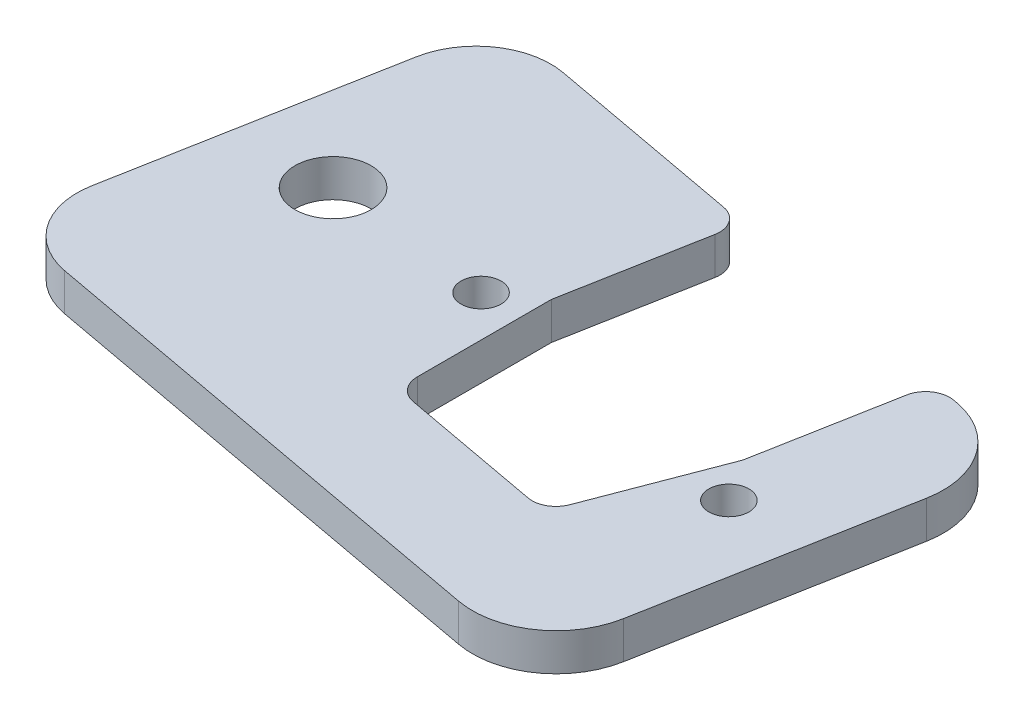
ISO-10303-21;
HEADER;
FILE_DESCRIPTION(('STEP AP214'),'2;1');
FILE_NAME('part.step','',(''),(''),'','','');
FILE_SCHEMA(('AUTOMOTIVE_DESIGN { 1 0 10303 214 1 1 1 1 }'));
ENDSEC;
DATA;
#1=APPLICATION_CONTEXT('core data for automotive mechanical design processes');
#2=APPLICATION_PROTOCOL_DEFINITION('international standard','automotive_design',2000,#1);
#3=PRODUCT_CONTEXT('',#1,'mechanical');
#4=PRODUCT('Part','Part','',(#3));
#5=PRODUCT_RELATED_PRODUCT_CATEGORY('part','',(#4));
#6=PRODUCT_DEFINITION_FORMATION('','',#4);
#7=PRODUCT_DEFINITION_CONTEXT('part definition',#1,'design');
#8=PRODUCT_DEFINITION('design','',#6,#7);
#9=PRODUCT_DEFINITION_SHAPE('','',#8);
#10=(LENGTH_UNIT() NAMED_UNIT(*) SI_UNIT(.MILLI.,.METRE.));
#11=(NAMED_UNIT(*) PLANE_ANGLE_UNIT() SI_UNIT($,.RADIAN.));
#12=(NAMED_UNIT(*) SI_UNIT($,.STERADIAN.) SOLID_ANGLE_UNIT());
#13=UNCERTAINTY_MEASURE_WITH_UNIT(LENGTH_MEASURE(1.E-05),#10,'distance_accuracy_value','');
#14=(GEOMETRIC_REPRESENTATION_CONTEXT(3) GLOBAL_UNCERTAINTY_ASSIGNED_CONTEXT((#13)) GLOBAL_UNIT_ASSIGNED_CONTEXT((#10,
#11,#12)) REPRESENTATION_CONTEXT('',''));
#15=CARTESIAN_POINT('',(0.,0.,0.));
#16=DIRECTION('',(0.,0.,1.));
#17=DIRECTION('',(1.,0.,0.));
#18=AXIS2_PLACEMENT_3D('',#15,#16,#17);
#19=CARTESIAN_POINT('',(-10.019436077678,3.175,2.3952555889969));
#20=DIRECTION('',(0.,-1.,0.));
#21=DIRECTION('',(0.,0.,-1.));
#22=AXIS2_PLACEMENT_3D('',#19,#20,#21);
#23=PLANE('',#22);
#24=CARTESIAN_POINT('',(-13.6812817654711,3.175,16.9843019035711));
#25=DIRECTION('',(0.,1.,0.));
#26=DIRECTION('',(0.,0.,1.));
#27=AXIS2_PLACEMENT_3D('',#24,#25,#26);
#28=CIRCLE('',#27,1.70180000000001);
#29=CARTESIAN_POINT('',(-13.6812817654711,3.175,18.6861019035711));
#30=VERTEX_POINT('',#29);
#31=EDGE_CURVE('E365',#30,#30,#28,.T.);
#32=ORIENTED_EDGE('',*,*,#31,.F.);
#33=EDGE_LOOP('',(#32));
#34=FACE_BOUND('',#33,.T.);
#35=CARTESIAN_POINT('',(-10.019436077678,3.175,2.3952555889969));
#36=DIRECTION('',(0.,1.,0.));
#37=DIRECTION('',(0.,0.,-1.));
#38=AXIS2_PLACEMENT_3D('',#35,#36,#37);
#39=CIRCLE('',#38,2.032);
#40=CARTESIAN_POINT('',(-8.02120076454232,3.175,2.76414531959057));
#41=VERTEX_POINT('',#40);
#42=CARTESIAN_POINT('',(-9.65054634708436,3.175,0.397020275861201));
#43=VERTEX_POINT('',#42);
#44=EDGE_CURVE('E225',#41,#43,#39,.T.);
#45=ORIENTED_EDGE('',*,*,#44,.T.);
#46=DIRECTION('',(-0.983383520243947,0.,-0.18154022174885));
#47=VECTOR('',#46,1.);
#48=CARTESIAN_POINT('',(-26.3857670945959,3.175,-2.69243121786074));
#49=LINE('',#48,#47);
#50=CARTESIAN_POINT('',(-26.3857670945959,3.175,-2.69243121786074));
#51=VERTEX_POINT('',#50);
#52=EDGE_CURVE('E123',#43,#51,#49,.T.);
#53=ORIENTED_EDGE('',*,*,#52,.T.);
#54=CARTESIAN_POINT('',(-27.5385475027011,3.175,3.55205413568833));
#55=DIRECTION('',(0.,1.,0.));
#56=DIRECTION('',(0.,0.,1.));
#57=AXIS2_PLACEMENT_3D('',#54,#55,#56);
#58=CIRCLE('',#57,6.35);
#59=CARTESIAN_POINT('',(-33.7830328562501,3.175,2.39927372758313));
#60=VERTEX_POINT('',#59);
#61=EDGE_CURVE('E270',#51,#60,#58,.T.);
#62=ORIENTED_EDGE('',*,*,#61,.T.);
#63=DIRECTION('',(-0.18154022174885,0.,0.983383520243947));
#64=VECTOR('',#63,1.);
#65=CARTESIAN_POINT('',(-38.0782926568501,3.175,25.6662261549069));
#66=LINE('',#65,#64);
#67=CARTESIAN_POINT('',(-38.0782926568501,3.175,25.6662261549069));
#68=VERTEX_POINT('',#67);
#69=EDGE_CURVE('E289',#60,#68,#66,.T.);
#70=ORIENTED_EDGE('',*,*,#69,.T.);
#71=CARTESIAN_POINT('',(-31.833807303301,3.175,26.8190065630121));
#72=DIRECTION('',(0.,1.,0.));
#73=DIRECTION('',(0.,0.,-1.));
#74=AXIS2_PLACEMENT_3D('',#71,#72,#73);
#75=CIRCLE('',#74,6.35);
#76=CARTESIAN_POINT('',(-32.9865877114062,3.175,33.0634919165612));
#77=VERTEX_POINT('',#76);
#78=EDGE_CURVE('E286',#68,#77,#75,.T.);
#79=ORIENTED_EDGE('',*,*,#78,.T.);
#80=DIRECTION('',(0.983383520243947,0.,0.18154022174885));
#81=VECTOR('',#80,1.);
#82=CARTESIAN_POINT('',(8.0771479735324,3.175,40.644175880261));
#83=LINE('',#82,#81);
#84=CARTESIAN_POINT('',(8.0771479735324,3.175,40.644175880261));
#85=VERTEX_POINT('',#84);
#86=EDGE_CURVE('E288',#77,#85,#83,.T.);
#87=ORIENTED_EDGE('',*,*,#86,.T.);
#88=CARTESIAN_POINT('',(9.36826203061022,3.175,33.6503522842861));
#89=DIRECTION('',(0.,1.,0.));
#90=DIRECTION('',(0.,0.,-1.));
#91=AXIS2_PLACEMENT_3D('',#88,#89,#90);
#92=CIRCLE('',#91,7.112);
#93=CARTESIAN_POINT('',(16.3620856265852,3.175,34.9414663413638));
#94=VERTEX_POINT('',#93);
#95=EDGE_CURVE('E291',#85,#94,#92,.T.);
#96=ORIENTED_EDGE('',*,*,#95,.T.);
#97=DIRECTION('',(0.181540221748844,0.,-0.983383520243949));
#98=VECTOR('',#97,1.);
#99=CARTESIAN_POINT('',(20.3806781292398,3.175,13.1731903988918));
#100=LINE('',#99,#98);
#101=CARTESIAN_POINT('',(20.3806781292398,3.175,13.1731903988918));
#102=VERTEX_POINT('',#101);
#103=EDGE_CURVE('E297',#94,#102,#100,.T.);
#104=ORIENTED_EDGE('',*,*,#103,.T.);
#105=CARTESIAN_POINT('',(13.3868545332648,3.175,11.882076341814));
#106=DIRECTION('',(0.,1.,0.));
#107=DIRECTION('',(0.,0.,-1.));
#108=AXIS2_PLACEMENT_3D('',#105,#106,#107);
#109=CIRCLE('',#108,7.112);
#110=CARTESIAN_POINT('',(14.6779685903426,3.175,4.88825274583903));
#111=VERTEX_POINT('',#110);
#112=EDGE_CURVE('E299',#102,#111,#109,.T.);
#113=ORIENTED_EDGE('',*,*,#112,.T.);
#114=DIRECTION('',(-0.983383520243947,0.,-0.181540221748852));
#115=VECTOR('',#114,1.);
#116=CARTESIAN_POINT('',(14.3032994691296,3.175,4.81908592135272));
#117=LINE('',#116,#115);
#118=CARTESIAN_POINT('',(14.3032994691296,3.175,4.81908592135272));
#119=VERTEX_POINT('',#118);
#120=EDGE_CURVE('E301',#111,#119,#117,.T.);
#121=ORIENTED_EDGE('',*,*,#120,.T.);
#122=CARTESIAN_POINT('',(13.934409738536,3.175,6.81732123448841));
#123=DIRECTION('',(0.,1.,0.));
#124=DIRECTION('',(0.,0.,-1.));
#125=AXIS2_PLACEMENT_3D('',#122,#123,#124);
#126=CIRCLE('',#125,2.032);
#127=CARTESIAN_POINT('',(11.9361744254003,3.175,6.44843150389477));
#128=VERTEX_POINT('',#127);
#129=EDGE_CURVE('E303',#119,#128,#126,.T.);
#130=ORIENTED_EDGE('',*,*,#129,.T.);
#131=DIRECTION('',(-0.181540221748844,0.,0.983383520243949));
#132=VECTOR('',#131,1.);
#133=CARTESIAN_POINT('',(9.76894725816258,3.175,18.188063968567));
#134=LINE('',#133,#132);
#135=CARTESIAN_POINT('',(9.76894725816258,3.175,18.188063968567));
#136=VERTEX_POINT('',#135);
#137=EDGE_CURVE('E305',#128,#136,#134,.T.);
#138=ORIENTED_EDGE('',*,*,#137,.T.);
#139=DIRECTION('',(-0.357047324658497,0.,0.934086295774759));
#140=VECTOR('',#139,1.);
#141=CARTESIAN_POINT('',(5.70172385872203,3.175,28.8284955777538));
#142=LINE('',#141,#140);
#143=CARTESIAN_POINT('',(5.70172385872203,3.175,28.8284955777538));
#144=VERTEX_POINT('',#143);
#145=EDGE_CURVE('E307',#136,#144,#142,.T.);
#146=ORIENTED_EDGE('',*,*,#145,.T.);
#147=CARTESIAN_POINT('',(3.80366050570772,3.175,28.1029754140478));
#148=DIRECTION('',(0.,-1.,0.));
#149=DIRECTION('',(0.,0.,1.));
#150=AXIS2_PLACEMENT_3D('',#147,#148,#149);
#151=CIRCLE('',#150,2.032);
#152=CARTESIAN_POINT('',(3.43477077511405,3.175,30.1012107271835));
#153=VERTEX_POINT('',#152);
#154=EDGE_CURVE('E309',#144,#153,#151,.T.);
#155=ORIENTED_EDGE('',*,*,#154,.T.);
#156=DIRECTION('',(-0.983383520243947,0.,-0.181540221748851));
#157=VECTOR('',#156,1.);
#158=CARTESIAN_POINT('',(-8.52531766237377,3.175,27.8932856782272));
#159=LINE('',#158,#157);
#160=CARTESIAN_POINT('',(-8.52531766237377,3.175,27.8932856782272));
#161=VERTEX_POINT('',#160);
#162=EDGE_CURVE('E172',#153,#161,#159,.T.);
#163=ORIENTED_EDGE('',*,*,#162,.T.);
#164=CARTESIAN_POINT('',(-8.1564279317801,3.175,25.8950503650915));
#165=DIRECTION('',(0.,-1.,0.));
#166=DIRECTION('',(0.,0.,-1.));
#167=AXIS2_PLACEMENT_3D('',#164,#165,#166);
#168=CIRCLE('',#167,2.032);
#169=CARTESIAN_POINT('',(-10.1884279317801,3.175,25.8950503650915));
#170=VERTEX_POINT('',#169);
#171=EDGE_CURVE('E166',#161,#170,#168,.T.);
#172=ORIENTED_EDGE('',*,*,#171,.T.);
#173=DIRECTION('',(0.,0.,-1.));
#174=VECTOR('',#173,1.);
#175=CARTESIAN_POINT('',(-10.1884279317801,3.175,14.5037777842628));
#176=LINE('',#175,#174);
#177=CARTESIAN_POINT('',(-10.1884279317801,3.175,14.5037777842628));
#178=VERTEX_POINT('',#177);
#179=EDGE_CURVE('E170',#170,#178,#176,.T.);
#180=ORIENTED_EDGE('',*,*,#179,.T.);
#181=DIRECTION('',(0.181540221748851,0.,-0.983383520243947));
#182=VECTOR('',#181,1.);
#183=CARTESIAN_POINT('',(-8.02120076454232,3.175,2.76414531959057));
#184=LINE('',#183,#182);
#185=EDGE_CURVE('E50',#178,#41,#184,.T.);
#186=ORIENTED_EDGE('',*,*,#185,.T.);
#187=EDGE_LOOP('',(#45,#53,#62,#70,#79,#87,#96,#104,#113,#121,#130,#138,#146,#155,#163,#172,
#180,#186));
#188=FACE_BOUND('',#187,.T.);
#189=CARTESIAN_POINT('',(12.1459096568077,3.175,21.7522016714942));
#190=DIRECTION('',(0.,1.,0.));
#191=DIRECTION('',(0.,0.,1.));
#192=AXIS2_PLACEMENT_3D('',#189,#190,#191);
#193=CIRCLE('',#192,1.70180000000001);
#194=CARTESIAN_POINT('',(12.1459096568077,3.175,23.4540016714942));
#195=VERTEX_POINT('',#194);
#196=EDGE_CURVE('E194',#195,#195,#193,.T.);
#197=ORIENTED_EDGE('',*,*,#196,.F.);
#198=EDGE_LOOP('',(#197));
#199=FACE_BOUND('',#198,.T.);
#200=CARTESIAN_POINT('',(-27.6879420898654,3.175,15.5544200799439));
#201=DIRECTION('',(0.,1.,0.));
#202=DIRECTION('',(0.,0.,1.));
#203=AXIS2_PLACEMENT_3D('',#200,#201,#202);
#204=CIRCLE('',#203,3.2385);
#205=CARTESIAN_POINT('',(-27.6879420898654,3.175,18.7929200799439));
#206=VERTEX_POINT('',#205);
#207=EDGE_CURVE('E356',#206,#206,#204,.T.);
#208=ORIENTED_EDGE('',*,*,#207,.F.);
#209=EDGE_LOOP('',(#208));
#210=FACE_BOUND('',#209,.T.);
#211=ADVANCED_FACE('F33',(#34,#188,#199,#210),#23,.F.);
#212=CARTESIAN_POINT('',(-10.019436077678,0.,2.3952555889969));
#213=DIRECTION('',(0.,-1.,0.));
#214=DIRECTION('',(0.,0.,-1.));
#215=AXIS2_PLACEMENT_3D('',#212,#213,#214);
#216=PLANE('',#215);
#217=CARTESIAN_POINT('',(-13.6812817654711,0.,16.9843019035711));
#218=DIRECTION('',(0.,1.,0.));
#219=DIRECTION('',(0.,0.,1.));
#220=AXIS2_PLACEMENT_3D('',#217,#218,#219);
#221=CIRCLE('',#220,1.70180000000001);
#222=CARTESIAN_POINT('',(-13.6812817654711,0.,18.6861019035711));
#223=VERTEX_POINT('',#222);
#224=EDGE_CURVE('E362',#223,#223,#221,.T.);
#225=ORIENTED_EDGE('',*,*,#224,.T.);
#226=EDGE_LOOP('',(#225));
#227=FACE_BOUND('',#226,.T.);
#228=CARTESIAN_POINT('',(-10.019436077678,0.,2.3952555889969));
#229=DIRECTION('',(0.,1.,0.));
#230=DIRECTION('',(0.,0.,-1.));
#231=AXIS2_PLACEMENT_3D('',#228,#229,#230);
#232=CIRCLE('',#231,2.032);
#233=CARTESIAN_POINT('',(-8.02120076454232,0.,2.76414531959057));
#234=VERTEX_POINT('',#233);
#235=CARTESIAN_POINT('',(-9.65054634708436,0.,0.397020275861201));
#236=VERTEX_POINT('',#235);
#237=EDGE_CURVE('E190',#234,#236,#232,.T.);
#238=ORIENTED_EDGE('',*,*,#237,.F.);
#239=DIRECTION('',(0.181540221748851,0.,-0.983383520243947));
#240=VECTOR('',#239,1.);
#241=CARTESIAN_POINT('',(-8.02120076454232,0.,2.76414531959057));
#242=LINE('',#241,#240);
#243=CARTESIAN_POINT('',(-10.1884279317801,0.,14.5037777842628));
#244=VERTEX_POINT('',#243);
#245=EDGE_CURVE('E115',#244,#234,#242,.T.);
#246=ORIENTED_EDGE('',*,*,#245,.F.);
#247=DIRECTION('',(0.,0.,-1.));
#248=VECTOR('',#247,1.);
#249=CARTESIAN_POINT('',(-10.1884279317801,0.,14.5037777842628));
#250=LINE('',#249,#248);
#251=CARTESIAN_POINT('',(-10.1884279317801,0.,25.8950503650915));
#252=VERTEX_POINT('',#251);
#253=EDGE_CURVE('E109',#252,#244,#250,.T.);
#254=ORIENTED_EDGE('',*,*,#253,.F.);
#255=CARTESIAN_POINT('',(-8.1564279317801,0.,25.8950503650915));
#256=DIRECTION('',(0.,-1.,0.));
#257=DIRECTION('',(0.,0.,-1.));
#258=AXIS2_PLACEMENT_3D('',#255,#256,#257);
#259=CIRCLE('',#258,2.032);
#260=CARTESIAN_POINT('',(-8.52531766237377,0.,27.8932856782272));
#261=VERTEX_POINT('',#260);
#262=EDGE_CURVE('E180',#261,#252,#259,.T.);
#263=ORIENTED_EDGE('',*,*,#262,.F.);
#264=DIRECTION('',(-0.983383520243947,0.,-0.181540221748851));
#265=VECTOR('',#264,1.);
#266=CARTESIAN_POINT('',(-8.52531766237377,0.,27.8932856782272));
#267=LINE('',#266,#265);
#268=CARTESIAN_POINT('',(3.43477077511405,0.,30.1012107271835));
#269=VERTEX_POINT('',#268);
#270=EDGE_CURVE('E220',#269,#261,#267,.T.);
#271=ORIENTED_EDGE('',*,*,#270,.F.);
#272=CARTESIAN_POINT('',(3.80366050570772,0.,28.1029754140478));
#273=DIRECTION('',(0.,-1.,0.));
#274=DIRECTION('',(0.,0.,1.));
#275=AXIS2_PLACEMENT_3D('',#272,#273,#274);
#276=CIRCLE('',#275,2.032);
#277=CARTESIAN_POINT('',(5.70172385872203,0.,28.8284955777538));
#278=VERTEX_POINT('',#277);
#279=EDGE_CURVE('E218',#278,#269,#276,.T.);
#280=ORIENTED_EDGE('',*,*,#279,.F.);
#281=DIRECTION('',(-0.357047324658497,0.,0.934086295774759));
#282=VECTOR('',#281,1.);
#283=CARTESIAN_POINT('',(5.70172385872203,0.,28.8284955777538));
#284=LINE('',#283,#282);
#285=CARTESIAN_POINT('',(9.76894725816258,0.,18.188063968567));
#286=VERTEX_POINT('',#285);
#287=EDGE_CURVE('E216',#286,#278,#284,.T.);
#288=ORIENTED_EDGE('',*,*,#287,.F.);
#289=DIRECTION('',(-0.181540221748844,0.,0.983383520243949));
#290=VECTOR('',#289,1.);
#291=CARTESIAN_POINT('',(9.76894725816258,0.,18.188063968567));
#292=LINE('',#291,#290);
#293=CARTESIAN_POINT('',(11.9361744254003,0.,6.44843150389477));
#294=VERTEX_POINT('',#293);
#295=EDGE_CURVE('E214',#294,#286,#292,.T.);
#296=ORIENTED_EDGE('',*,*,#295,.F.);
#297=CARTESIAN_POINT('',(13.934409738536,0.,6.81732123448841));
#298=DIRECTION('',(0.,1.,0.));
#299=DIRECTION('',(0.,0.,-1.));
#300=AXIS2_PLACEMENT_3D('',#297,#298,#299);
#301=CIRCLE('',#300,2.032);
#302=CARTESIAN_POINT('',(14.3032994691296,0.,4.81908592135272));
#303=VERTEX_POINT('',#302);
#304=EDGE_CURVE('E212',#303,#294,#301,.T.);
#305=ORIENTED_EDGE('',*,*,#304,.F.);
#306=DIRECTION('',(-0.983383520243947,0.,-0.181540221748852));
#307=VECTOR('',#306,1.);
#308=CARTESIAN_POINT('',(14.3032994691296,0.,4.81908592135272));
#309=LINE('',#308,#307);
#310=CARTESIAN_POINT('',(14.6779685903426,0.,4.88825274583903));
#311=VERTEX_POINT('',#310);
#312=EDGE_CURVE('E210',#311,#303,#309,.T.);
#313=ORIENTED_EDGE('',*,*,#312,.F.);
#314=CARTESIAN_POINT('',(13.3868545332648,0.,11.882076341814));
#315=DIRECTION('',(0.,1.,0.));
#316=DIRECTION('',(0.,0.,-1.));
#317=AXIS2_PLACEMENT_3D('',#314,#315,#316);
#318=CIRCLE('',#317,7.112);
#319=CARTESIAN_POINT('',(20.3806781292398,0.,13.1731903988918));
#320=VERTEX_POINT('',#319);
#321=EDGE_CURVE('E208',#320,#311,#318,.T.);
#322=ORIENTED_EDGE('',*,*,#321,.F.);
#323=DIRECTION('',(0.181540221748844,0.,-0.983383520243949));
#324=VECTOR('',#323,1.);
#325=CARTESIAN_POINT('',(20.3806781292398,0.,13.1731903988918));
#326=LINE('',#325,#324);
#327=CARTESIAN_POINT('',(16.3620856265852,0.,34.9414663413638));
#328=VERTEX_POINT('',#327);
#329=EDGE_CURVE('E206',#328,#320,#326,.T.);
#330=ORIENTED_EDGE('',*,*,#329,.F.);
#331=CARTESIAN_POINT('',(9.36826203061022,0.,33.6503522842861));
#332=DIRECTION('',(0.,1.,0.));
#333=DIRECTION('',(0.,0.,-1.));
#334=AXIS2_PLACEMENT_3D('',#331,#332,#333);
#335=CIRCLE('',#334,7.112);
#336=CARTESIAN_POINT('',(8.0771479735324,0.,40.644175880261));
#337=VERTEX_POINT('',#336);
#338=EDGE_CURVE('E204',#337,#328,#335,.T.);
#339=ORIENTED_EDGE('',*,*,#338,.F.);
#340=DIRECTION('',(0.983383520243947,0.,0.18154022174885));
#341=VECTOR('',#340,1.);
#342=CARTESIAN_POINT('',(8.0771479735324,0.,40.644175880261));
#343=LINE('',#342,#341);
#344=CARTESIAN_POINT('',(-32.9865877114062,0.,33.0634919165612));
#345=VERTEX_POINT('',#344);
#346=EDGE_CURVE('E202',#345,#337,#343,.T.);
#347=ORIENTED_EDGE('',*,*,#346,.F.);
#348=CARTESIAN_POINT('',(-31.833807303301,0.,26.8190065630121));
#349=DIRECTION('',(0.,1.,0.));
#350=DIRECTION('',(0.,0.,-1.));
#351=AXIS2_PLACEMENT_3D('',#348,#349,#350);
#352=CIRCLE('',#351,6.35);
#353=CARTESIAN_POINT('',(-38.0782926568501,0.,25.6662261549069));
#354=VERTEX_POINT('',#353);
#355=EDGE_CURVE('E200',#354,#345,#352,.T.);
#356=ORIENTED_EDGE('',*,*,#355,.F.);
#357=DIRECTION('',(-0.18154022174885,0.,0.983383520243947));
#358=VECTOR('',#357,1.);
#359=CARTESIAN_POINT('',(-38.0782926568501,0.,25.6662261549069));
#360=LINE('',#359,#358);
#361=CARTESIAN_POINT('',(-33.7830328562501,0.,2.39927372758313));
#362=VERTEX_POINT('',#361);
#363=EDGE_CURVE('E198',#362,#354,#360,.T.);
#364=ORIENTED_EDGE('',*,*,#363,.F.);
#365=CARTESIAN_POINT('',(-27.5385475027011,0.,3.55205413568833));
#366=DIRECTION('',(0.,1.,0.));
#367=DIRECTION('',(0.,0.,1.));
#368=AXIS2_PLACEMENT_3D('',#365,#366,#367);
#369=CIRCLE('',#368,6.35);
#370=CARTESIAN_POINT('',(-26.3857670945959,0.,-2.69243121786074));
#371=VERTEX_POINT('',#370);
#372=EDGE_CURVE('E196',#371,#362,#369,.T.);
#373=ORIENTED_EDGE('',*,*,#372,.F.);
#374=DIRECTION('',(-0.983383520243947,0.,-0.18154022174885));
#375=VECTOR('',#374,1.);
#376=CARTESIAN_POINT('',(-26.3857670945959,0.,-2.69243121786074));
#377=LINE('',#376,#375);
#378=EDGE_CURVE('E193',#236,#371,#377,.T.);
#379=ORIENTED_EDGE('',*,*,#378,.F.);
#380=EDGE_LOOP('',(#238,#246,#254,#263,#271,#280,#288,#296,#305,#313,#322,#330,#339,#347,#356,
#364,#373,#379));
#381=FACE_BOUND('',#380,.T.);
#382=CARTESIAN_POINT('',(12.1459096568077,0.,21.7522016714942));
#383=DIRECTION('',(0.,1.,0.));
#384=DIRECTION('',(0.,0.,1.));
#385=AXIS2_PLACEMENT_3D('',#382,#383,#384);
#386=CIRCLE('',#385,1.70180000000001);
#387=CARTESIAN_POINT('',(12.1459096568077,0.,23.4540016714942));
#388=VERTEX_POINT('',#387);
#389=EDGE_CURVE('E368',#388,#388,#386,.T.);
#390=ORIENTED_EDGE('',*,*,#389,.T.);
#391=EDGE_LOOP('',(#390));
#392=FACE_BOUND('',#391,.T.);
#393=CARTESIAN_POINT('',(-27.6879420898654,0.,15.5544200799439));
#394=DIRECTION('',(0.,1.,0.));
#395=DIRECTION('',(0.,0.,1.));
#396=AXIS2_PLACEMENT_3D('',#393,#394,#395);
#397=CIRCLE('',#396,3.2385);
#398=CARTESIAN_POINT('',(-27.6879420898654,0.,18.7929200799439));
#399=VERTEX_POINT('',#398);
#400=EDGE_CURVE('E359',#399,#399,#397,.T.);
#401=ORIENTED_EDGE('',*,*,#400,.T.);
#402=EDGE_LOOP('',(#401));
#403=FACE_BOUND('',#402,.T.);
#404=ADVANCED_FACE('F274',(#227,#381,#392,#403),#216,.T.);
#405=CARTESIAN_POINT('',(-10.019436077678,3.175,2.3952555889969));
#406=DIRECTION('',(0.,-1.,0.));
#407=DIRECTION('',(0.,0.,-1.));
#408=AXIS2_PLACEMENT_3D('',#405,#406,#407);
#409=CYLINDRICAL_SURFACE('',#408,2.032);
#410=ORIENTED_EDGE('',*,*,#237,.T.);
#411=DIRECTION('',(0.,-1.,0.));
#412=VECTOR('',#411,1.);
#413=CARTESIAN_POINT('',(-9.65054634708436,3.175,0.397020275861201));
#414=LINE('',#413,#412);
#415=EDGE_CURVE('E11',#43,#236,#414,.T.);
#416=ORIENTED_EDGE('',*,*,#415,.F.);
#417=ORIENTED_EDGE('',*,*,#44,.F.);
#418=DIRECTION('',(0.,-1.,0.));
#419=VECTOR('',#418,1.);
#420=CARTESIAN_POINT('',(-8.02120076454232,3.175,2.76414531959057));
#421=LINE('',#420,#419);
#422=EDGE_CURVE('E186',#41,#234,#421,.T.);
#423=ORIENTED_EDGE('',*,*,#422,.T.);
#424=EDGE_LOOP('',(#410,#416,#417,#423));
#425=FACE_BOUND('',#424,.T.);
#426=ADVANCED_FACE('F35',(#425),#409,.T.);
#427=CARTESIAN_POINT('',(-26.3857670945959,3.175,-2.69243121786074));
#428=DIRECTION('',(-0.18154022174885,0.,0.983383520243947));
#429=DIRECTION('',(0.983383520243947,0.,0.18154022174885));
#430=AXIS2_PLACEMENT_3D('',#427,#428,#429);
#431=PLANE('',#430);
#432=ORIENTED_EDGE('',*,*,#378,.T.);
#433=DIRECTION('',(0.,-1.,0.));
#434=VECTOR('',#433,1.);
#435=CARTESIAN_POINT('',(-26.3857670945959,3.175,-2.69243121786074));
#436=LINE('',#435,#434);
#437=EDGE_CURVE('E42',#51,#371,#436,.T.);
#438=ORIENTED_EDGE('',*,*,#437,.F.);
#439=ORIENTED_EDGE('',*,*,#52,.F.);
#440=ORIENTED_EDGE('',*,*,#415,.T.);
#441=EDGE_LOOP('',(#432,#438,#439,#440));
#442=FACE_BOUND('',#441,.T.);
#443=ADVANCED_FACE('F529',(#442),#431,.F.);
#444=CARTESIAN_POINT('',(-27.5385475027011,3.175,3.55205413568833));
#445=DIRECTION('',(0.,-1.,0.));
#446=DIRECTION('',(0.,0.,-1.));
#447=AXIS2_PLACEMENT_3D('',#444,#445,#446);
#448=CYLINDRICAL_SURFACE('',#447,6.35);
#449=ORIENTED_EDGE('',*,*,#372,.T.);
#450=DIRECTION('',(0.,-1.,0.));
#451=VECTOR('',#450,1.);
#452=CARTESIAN_POINT('',(-33.7830328562501,3.175,2.39927372758313));
#453=LINE('',#452,#451);
#454=EDGE_CURVE('E262',#60,#362,#453,.T.);
#455=ORIENTED_EDGE('',*,*,#454,.F.);
#456=ORIENTED_EDGE('',*,*,#61,.F.);
#457=ORIENTED_EDGE('',*,*,#437,.T.);
#458=EDGE_LOOP('',(#449,#455,#456,#457));
#459=FACE_BOUND('',#458,.T.);
#460=ADVANCED_FACE('F268',(#459),#448,.T.);
#461=CARTESIAN_POINT('',(-38.0782926568501,3.175,25.6662261549069));
#462=DIRECTION('',(0.983383520243947,0.,0.18154022174885));
#463=DIRECTION('',(0.18154022174885,0.,-0.983383520243947));
#464=AXIS2_PLACEMENT_3D('',#461,#462,#463);
#465=PLANE('',#464);
#466=ORIENTED_EDGE('',*,*,#363,.T.);
#467=DIRECTION('',(0.,-1.,0.));
#468=VECTOR('',#467,1.);
#469=CARTESIAN_POINT('',(-38.0782926568501,3.175,25.6662261549069));
#470=LINE('',#469,#468);
#471=EDGE_CURVE('E259',#68,#354,#470,.T.);
#472=ORIENTED_EDGE('',*,*,#471,.F.);
#473=ORIENTED_EDGE('',*,*,#69,.F.);
#474=ORIENTED_EDGE('',*,*,#454,.T.);
#475=EDGE_LOOP('',(#466,#472,#473,#474));
#476=FACE_BOUND('',#475,.T.);
#477=ADVANCED_FACE('F280',(#476),#465,.F.);
#478=CARTESIAN_POINT('',(-31.833807303301,3.175,26.8190065630121));
#479=DIRECTION('',(0.,-1.,0.));
#480=DIRECTION('',(0.,0.,-1.));
#481=AXIS2_PLACEMENT_3D('',#478,#479,#480);
#482=CYLINDRICAL_SURFACE('',#481,6.35);
#483=ORIENTED_EDGE('',*,*,#355,.T.);
#484=DIRECTION('',(0.,-1.,0.));
#485=VECTOR('',#484,1.);
#486=CARTESIAN_POINT('',(-32.9865877114062,3.175,33.0634919165612));
#487=LINE('',#486,#485);
#488=EDGE_CURVE('E256',#77,#345,#487,.T.);
#489=ORIENTED_EDGE('',*,*,#488,.F.);
#490=ORIENTED_EDGE('',*,*,#78,.F.);
#491=ORIENTED_EDGE('',*,*,#471,.T.);
#492=EDGE_LOOP('',(#483,#489,#490,#491));
#493=FACE_BOUND('',#492,.T.);
#494=ADVANCED_FACE('F284',(#493),#482,.T.);
#495=CARTESIAN_POINT('',(8.0771479735324,3.175,40.644175880261));
#496=DIRECTION('',(0.18154022174885,0.,-0.983383520243947));
#497=DIRECTION('',(-0.983383520243947,0.,-0.18154022174885));
#498=AXIS2_PLACEMENT_3D('',#495,#496,#497);
#499=PLANE('',#498);
#500=ORIENTED_EDGE('',*,*,#346,.T.);
#501=DIRECTION('',(0.,-1.,0.));
#502=VECTOR('',#501,1.);
#503=CARTESIAN_POINT('',(8.0771479735324,3.175,40.644175880261));
#504=LINE('',#503,#502);
#505=EDGE_CURVE('E253',#85,#337,#504,.T.);
#506=ORIENTED_EDGE('',*,*,#505,.F.);
#507=ORIENTED_EDGE('',*,*,#86,.F.);
#508=ORIENTED_EDGE('',*,*,#488,.T.);
#509=EDGE_LOOP('',(#500,#506,#507,#508));
#510=FACE_BOUND('',#509,.T.);
#511=ADVANCED_FACE('F494',(#510),#499,.F.);
#512=CARTESIAN_POINT('',(9.36826203061022,3.175,33.6503522842861));
#513=DIRECTION('',(0.,-1.,0.));
#514=DIRECTION('',(0.,0.,-1.));
#515=AXIS2_PLACEMENT_3D('',#512,#513,#514);
#516=CYLINDRICAL_SURFACE('',#515,7.112);
#517=ORIENTED_EDGE('',*,*,#338,.T.);
#518=DIRECTION('',(0.,-1.,0.));
#519=VECTOR('',#518,1.);
#520=CARTESIAN_POINT('',(16.3620856265852,3.175,34.9414663413638));
#521=LINE('',#520,#519);
#522=EDGE_CURVE('E250',#94,#328,#521,.T.);
#523=ORIENTED_EDGE('',*,*,#522,.F.);
#524=ORIENTED_EDGE('',*,*,#95,.F.);
#525=ORIENTED_EDGE('',*,*,#505,.T.);
#526=EDGE_LOOP('',(#517,#523,#524,#525));
#527=FACE_BOUND('',#526,.T.);
#528=ADVANCED_FACE('F484',(#527),#516,.T.);
#529=CARTESIAN_POINT('',(20.3806781292398,3.175,13.1731903988918));
#530=DIRECTION('',(-0.983383520243949,0.,-0.181540221748844));
#531=DIRECTION('',(-0.181540221748844,0.,0.983383520243949));
#532=AXIS2_PLACEMENT_3D('',#529,#530,#531);
#533=PLANE('',#532);
#534=ORIENTED_EDGE('',*,*,#329,.T.);
#535=DIRECTION('',(0.,-1.,0.));
#536=VECTOR('',#535,1.);
#537=CARTESIAN_POINT('',(20.3806781292398,3.175,13.1731903988918));
#538=LINE('',#537,#536);
#539=EDGE_CURVE('E247',#102,#320,#538,.T.);
#540=ORIENTED_EDGE('',*,*,#539,.F.);
#541=ORIENTED_EDGE('',*,*,#103,.F.);
#542=ORIENTED_EDGE('',*,*,#522,.T.);
#543=EDGE_LOOP('',(#534,#540,#541,#542));
#544=FACE_BOUND('',#543,.T.);
#545=ADVANCED_FACE('F474',(#544),#533,.F.);
#546=CARTESIAN_POINT('',(13.3868545332648,3.175,11.882076341814));
#547=DIRECTION('',(0.,-1.,0.));
#548=DIRECTION('',(0.,0.,-1.));
#549=AXIS2_PLACEMENT_3D('',#546,#547,#548);
#550=CYLINDRICAL_SURFACE('',#549,7.112);
#551=ORIENTED_EDGE('',*,*,#321,.T.);
#552=DIRECTION('',(0.,-1.,0.));
#553=VECTOR('',#552,1.);
#554=CARTESIAN_POINT('',(14.6779685903426,3.175,4.88825274583903));
#555=LINE('',#554,#553);
#556=EDGE_CURVE('E244',#111,#311,#555,.T.);
#557=ORIENTED_EDGE('',*,*,#556,.F.);
#558=ORIENTED_EDGE('',*,*,#112,.F.);
#559=ORIENTED_EDGE('',*,*,#539,.T.);
#560=EDGE_LOOP('',(#551,#557,#558,#559));
#561=FACE_BOUND('',#560,.T.);
#562=ADVANCED_FACE('F464',(#561),#550,.T.);
#563=CARTESIAN_POINT('',(14.3032994691296,3.175,4.81908592135272));
#564=DIRECTION('',(-0.181540221748852,0.,0.983383520243947));
#565=DIRECTION('',(0.983383520243947,0.,0.181540221748852));
#566=AXIS2_PLACEMENT_3D('',#563,#564,#565);
#567=PLANE('',#566);
#568=ORIENTED_EDGE('',*,*,#312,.T.);
#569=DIRECTION('',(0.,-1.,0.));
#570=VECTOR('',#569,1.);
#571=CARTESIAN_POINT('',(14.3032994691296,3.175,4.81908592135272));
#572=LINE('',#571,#570);
#573=EDGE_CURVE('E241',#119,#303,#572,.T.);
#574=ORIENTED_EDGE('',*,*,#573,.F.);
#575=ORIENTED_EDGE('',*,*,#120,.F.);
#576=ORIENTED_EDGE('',*,*,#556,.T.);
#577=EDGE_LOOP('',(#568,#574,#575,#576));
#578=FACE_BOUND('',#577,.T.);
#579=ADVANCED_FACE('F454',(#578),#567,.F.);
#580=CARTESIAN_POINT('',(13.934409738536,3.175,6.81732123448841));
#581=DIRECTION('',(0.,-1.,0.));
#582=DIRECTION('',(0.,0.,-1.));
#583=AXIS2_PLACEMENT_3D('',#580,#581,#582);
#584=CYLINDRICAL_SURFACE('',#583,2.032);
#585=ORIENTED_EDGE('',*,*,#304,.T.);
#586=DIRECTION('',(0.,-1.,0.));
#587=VECTOR('',#586,1.);
#588=CARTESIAN_POINT('',(11.9361744254003,3.175,6.44843150389477));
#589=LINE('',#588,#587);
#590=EDGE_CURVE('E238',#128,#294,#589,.T.);
#591=ORIENTED_EDGE('',*,*,#590,.F.);
#592=ORIENTED_EDGE('',*,*,#129,.F.);
#593=ORIENTED_EDGE('',*,*,#573,.T.);
#594=EDGE_LOOP('',(#585,#591,#592,#593));
#595=FACE_BOUND('',#594,.T.);
#596=ADVANCED_FACE('F444',(#595),#584,.T.);
#597=CARTESIAN_POINT('',(9.76894725816258,3.175,18.188063968567));
#598=DIRECTION('',(0.983383520243949,0.,0.181540221748844));
#599=DIRECTION('',(0.181540221748844,0.,-0.983383520243949));
#600=AXIS2_PLACEMENT_3D('',#597,#598,#599);
#601=PLANE('',#600);
#602=ORIENTED_EDGE('',*,*,#295,.T.);
#603=DIRECTION('',(0.,-1.,0.));
#604=VECTOR('',#603,1.);
#605=CARTESIAN_POINT('',(9.76894725816258,3.175,18.188063968567));
#606=LINE('',#605,#604);
#607=EDGE_CURVE('E235',#136,#286,#606,.T.);
#608=ORIENTED_EDGE('',*,*,#607,.F.);
#609=ORIENTED_EDGE('',*,*,#137,.F.);
#610=ORIENTED_EDGE('',*,*,#590,.T.);
#611=EDGE_LOOP('',(#602,#608,#609,#610));
#612=FACE_BOUND('',#611,.T.);
#613=ADVANCED_FACE('F434',(#612),#601,.F.);
#614=CARTESIAN_POINT('',(5.70172385872203,3.175,28.8284955777538));
#615=DIRECTION('',(0.934086295774759,0.,0.357047324658497));
#616=DIRECTION('',(0.357047324658497,0.,-0.934086295774759));
#617=AXIS2_PLACEMENT_3D('',#614,#615,#616);
#618=PLANE('',#617);
#619=ORIENTED_EDGE('',*,*,#287,.T.);
#620=DIRECTION('',(0.,-1.,0.));
#621=VECTOR('',#620,1.);
#622=CARTESIAN_POINT('',(5.70172385872203,3.175,28.8284955777538));
#623=LINE('',#622,#621);
#624=EDGE_CURVE('E232',#144,#278,#623,.T.);
#625=ORIENTED_EDGE('',*,*,#624,.F.);
#626=ORIENTED_EDGE('',*,*,#145,.F.);
#627=ORIENTED_EDGE('',*,*,#607,.T.);
#628=EDGE_LOOP('',(#619,#625,#626,#627));
#629=FACE_BOUND('',#628,.T.);
#630=ADVANCED_FACE('F425',(#629),#618,.F.);
#631=CARTESIAN_POINT('',(3.80366050570772,3.175,28.1029754140478));
#632=DIRECTION('',(0.,-1.,0.));
#633=DIRECTION('',(0.,0.,-1.));
#634=AXIS2_PLACEMENT_3D('',#631,#632,#633);
#635=CYLINDRICAL_SURFACE('',#634,2.032);
#636=ORIENTED_EDGE('',*,*,#279,.T.);
#637=DIRECTION('',(0.,-1.,0.));
#638=VECTOR('',#637,1.);
#639=CARTESIAN_POINT('',(3.43477077511405,3.175,30.1012107271835));
#640=LINE('',#639,#638);
#641=EDGE_CURVE('E229',#153,#269,#640,.T.);
#642=ORIENTED_EDGE('',*,*,#641,.F.);
#643=ORIENTED_EDGE('',*,*,#154,.F.);
#644=ORIENTED_EDGE('',*,*,#624,.T.);
#645=EDGE_LOOP('',(#636,#642,#643,#644));
#646=FACE_BOUND('',#645,.T.);
#647=ADVANCED_FACE('F315',(#646),#635,.F.);
#648=CARTESIAN_POINT('',(-8.52531766237377,3.175,27.8932856782272));
#649=DIRECTION('',(-0.181540221748851,0.,0.983383520243947));
#650=DIRECTION('',(0.983383520243947,0.,0.181540221748851));
#651=AXIS2_PLACEMENT_3D('',#648,#649,#650);
#652=PLANE('',#651);
#653=ORIENTED_EDGE('',*,*,#270,.T.);
#654=DIRECTION('',(0.,-1.,0.));
#655=VECTOR('',#654,1.);
#656=CARTESIAN_POINT('',(-8.52531766237377,3.175,27.8932856782272));
#657=LINE('',#656,#655);
#658=EDGE_CURVE('E181',#161,#261,#657,.T.);
#659=ORIENTED_EDGE('',*,*,#658,.F.);
#660=ORIENTED_EDGE('',*,*,#162,.F.);
#661=ORIENTED_EDGE('',*,*,#641,.T.);
#662=EDGE_LOOP('',(#653,#659,#660,#661));
#663=FACE_BOUND('',#662,.T.);
#664=ADVANCED_FACE('F319',(#663),#652,.F.);
#665=CARTESIAN_POINT('',(-8.1564279317801,3.175,25.8950503650915));
#666=DIRECTION('',(0.,-1.,0.));
#667=DIRECTION('',(0.,0.,-1.));
#668=AXIS2_PLACEMENT_3D('',#665,#666,#667);
#669=CYLINDRICAL_SURFACE('',#668,2.032);
#670=ORIENTED_EDGE('',*,*,#262,.T.);
#671=DIRECTION('',(0.,-1.,0.));
#672=VECTOR('',#671,1.);
#673=CARTESIAN_POINT('',(-10.1884279317801,3.175,25.8950503650915));
#674=LINE('',#673,#672);
#675=EDGE_CURVE('E177',#170,#252,#674,.T.);
#676=ORIENTED_EDGE('',*,*,#675,.F.);
#677=ORIENTED_EDGE('',*,*,#171,.F.);
#678=ORIENTED_EDGE('',*,*,#658,.T.);
#679=EDGE_LOOP('',(#670,#676,#677,#678));
#680=FACE_BOUND('',#679,.T.);
#681=ADVANCED_FACE('F178',(#680),#669,.F.);
#682=CARTESIAN_POINT('',(-10.1884279317801,3.175,14.5037777842628));
#683=DIRECTION('',(-1.,0.,0.));
#684=DIRECTION('',(0.,0.,1.));
#685=AXIS2_PLACEMENT_3D('',#682,#683,#684);
#686=PLANE('',#685);
#687=ORIENTED_EDGE('',*,*,#253,.T.);
#688=DIRECTION('',(0.,-1.,0.));
#689=VECTOR('',#688,1.);
#690=CARTESIAN_POINT('',(-10.1884279317801,3.175,14.5037777842628));
#691=LINE('',#690,#689);
#692=EDGE_CURVE('E182',#178,#244,#691,.T.);
#693=ORIENTED_EDGE('',*,*,#692,.F.);
#694=ORIENTED_EDGE('',*,*,#179,.F.);
#695=ORIENTED_EDGE('',*,*,#675,.T.);
#696=EDGE_LOOP('',(#687,#693,#694,#695));
#697=FACE_BOUND('',#696,.T.);
#698=ADVANCED_FACE('F184',(#697),#686,.F.);
#699=CARTESIAN_POINT('',(-8.02120076454232,3.175,2.76414531959057));
#700=DIRECTION('',(-0.983383520243947,0.,-0.181540221748851));
#701=DIRECTION('',(-0.181540221748851,0.,0.983383520243947));
#702=AXIS2_PLACEMENT_3D('',#699,#700,#701);
#703=PLANE('',#702);
#704=ORIENTED_EDGE('',*,*,#245,.T.);
#705=ORIENTED_EDGE('',*,*,#422,.F.);
#706=ORIENTED_EDGE('',*,*,#185,.F.);
#707=ORIENTED_EDGE('',*,*,#692,.T.);
#708=EDGE_LOOP('',(#704,#705,#706,#707));
#709=FACE_BOUND('',#708,.T.);
#710=ADVANCED_FACE('F323',(#709),#703,.F.);
#711=CARTESIAN_POINT('',(12.1459096568077,3.175,21.7522016714942));
#712=DIRECTION('',(0.,-1.,0.));
#713=DIRECTION('',(0.,0.,-1.));
#714=AXIS2_PLACEMENT_3D('',#711,#712,#713);
#715=CYLINDRICAL_SURFACE('',#714,1.70180000000001);
#716=ORIENTED_EDGE('',*,*,#196,.T.);
#717=EDGE_LOOP('',(#716));
#718=FACE_BOUND('',#717,.T.);
#719=ORIENTED_EDGE('',*,*,#389,.F.);
#720=EDGE_LOOP('',(#719));
#721=FACE_BOUND('',#720,.T.);
#722=ADVANCED_FACE('F325',(#718,#721),#715,.F.);
#723=CARTESIAN_POINT('',(-13.6812817654711,3.175,16.9843019035711));
#724=DIRECTION('',(0.,-1.,0.));
#725=DIRECTION('',(0.,0.,-1.));
#726=AXIS2_PLACEMENT_3D('',#723,#724,#725);
#727=CYLINDRICAL_SURFACE('',#726,1.70180000000001);
#728=ORIENTED_EDGE('',*,*,#31,.T.);
#729=EDGE_LOOP('',(#728));
#730=FACE_BOUND('',#729,.T.);
#731=ORIENTED_EDGE('',*,*,#224,.F.);
#732=EDGE_LOOP('',(#731));
#733=FACE_BOUND('',#732,.T.);
#734=ADVANCED_FACE('F331',(#730,#733),#727,.F.);
#735=CARTESIAN_POINT('',(-27.6879420898654,3.175,15.5544200799439));
#736=DIRECTION('',(0.,-1.,0.));
#737=DIRECTION('',(0.,0.,-1.));
#738=AXIS2_PLACEMENT_3D('',#735,#736,#737);
#739=CYLINDRICAL_SURFACE('',#738,3.2385);
#740=ORIENTED_EDGE('',*,*,#207,.T.);
#741=EDGE_LOOP('',(#740));
#742=FACE_BOUND('',#741,.T.);
#743=ORIENTED_EDGE('',*,*,#400,.F.);
#744=EDGE_LOOP('',(#743));
#745=FACE_BOUND('',#744,.T.);
#746=ADVANCED_FACE('F347',(#742,#745),#739,.F.);
#747=CLOSED_SHELL('',(#211,#404,#426,#443,#460,#477,#494,#511,#528,#545,#562,#579,#596,#613,
#630,#647,#664,#681,#698,#710,#722,#734,#746));
#748=MANIFOLD_SOLID_BREP('B2',#747);
#749=ADVANCED_BREP_SHAPE_REPRESENTATION('',(#18,#748),#14);
#750=SHAPE_DEFINITION_REPRESENTATION(#9,#749);
ENDSEC;
END-ISO-10303-21;
